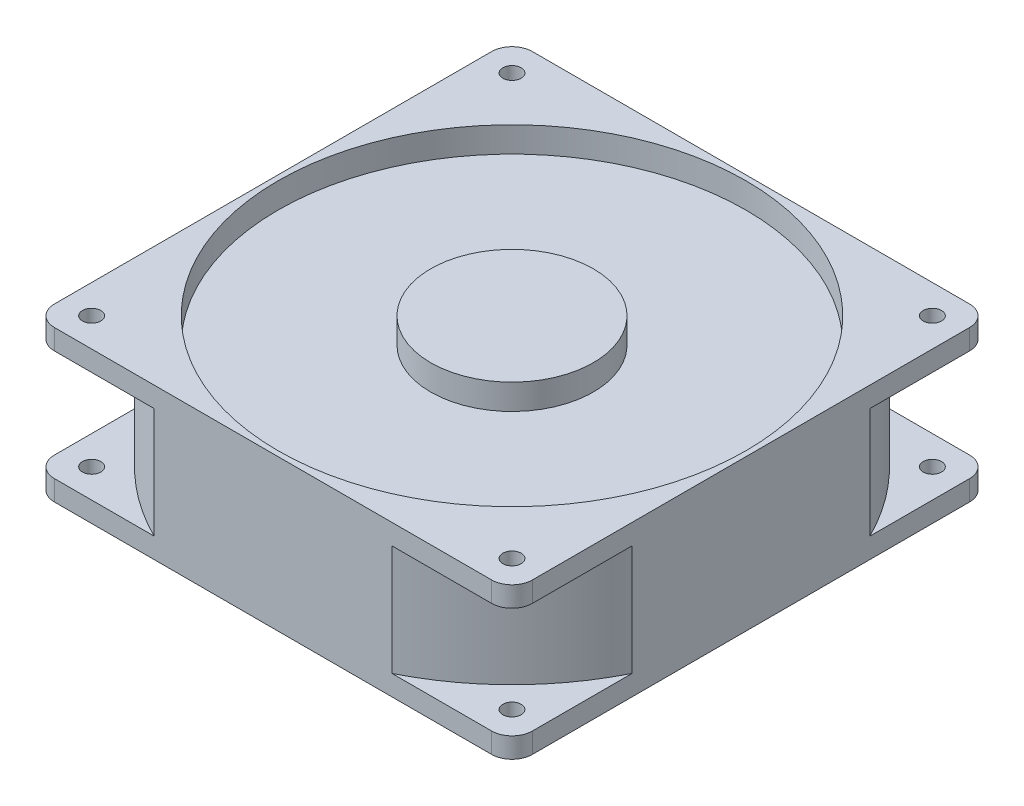
ISO-10303-21;
HEADER;
FILE_DESCRIPTION(('STEP AP214'),'2;1');
FILE_NAME('part.step','',(''),(''),'','','');
FILE_SCHEMA(('AUTOMOTIVE_DESIGN { 1 0 10303 214 1 1 1 1 }'));
ENDSEC;
DATA;
#1=APPLICATION_CONTEXT('core data for automotive mechanical design processes');
#2=APPLICATION_PROTOCOL_DEFINITION('international standard','automotive_design',2000,#1);
#3=PRODUCT_CONTEXT('',#1,'mechanical');
#4=PRODUCT('Part','Part','',(#3));
#5=PRODUCT_RELATED_PRODUCT_CATEGORY('part','',(#4));
#6=PRODUCT_DEFINITION_FORMATION('','',#4);
#7=PRODUCT_DEFINITION_CONTEXT('part definition',#1,'design');
#8=PRODUCT_DEFINITION('design','',#6,#7);
#9=PRODUCT_DEFINITION_SHAPE('','',#8);
#10=(LENGTH_UNIT() NAMED_UNIT(*) SI_UNIT(.MILLI.,.METRE.));
#11=(NAMED_UNIT(*) PLANE_ANGLE_UNIT() SI_UNIT($,.RADIAN.));
#12=(NAMED_UNIT(*) SI_UNIT($,.STERADIAN.) SOLID_ANGLE_UNIT());
#13=UNCERTAINTY_MEASURE_WITH_UNIT(LENGTH_MEASURE(1.E-05),#10,'distance_accuracy_value','');
#14=(GEOMETRIC_REPRESENTATION_CONTEXT(3) GLOBAL_UNCERTAINTY_ASSIGNED_CONTEXT((#13)) GLOBAL_UNIT_ASSIGNED_CONTEXT((#10,
#11,#12)) REPRESENTATION_CONTEXT('',''));
#15=CARTESIAN_POINT('',(0.,0.,0.));
#16=DIRECTION('',(0.,0.,1.));
#17=DIRECTION('',(1.,0.,0.));
#18=AXIS2_PLACEMENT_3D('',#15,#16,#17);
#19=CARTESIAN_POINT('',(2.67817733585345,37.75,-111.051162790698));
#20=DIRECTION('',(-1.,0.,0.));
#21=DIRECTION('',(0.,0.,1.));
#22=AXIS2_PLACEMENT_3D('',#19,#20,#21);
#23=PLANE('',#22);
#24=DIRECTION('',(0.,0.,-1.));
#25=VECTOR('',#24,1.);
#26=CARTESIAN_POINT('',(2.67817733585345,5.075,-111.051162790698));
#27=LINE('',#26,#25);
#28=CARTESIAN_POINT('',(2.67817733585345,5.075,3.24883720930234));
#29=VERTEX_POINT('',#28);
#30=CARTESIAN_POINT('',(2.67817733585345,5.075,-21.6515763748621));
#31=VERTEX_POINT('',#30);
#32=EDGE_CURVE('E368',#29,#31,#27,.T.);
#33=ORIENTED_EDGE('',*,*,#32,.F.);
#34=DIRECTION('',(0.,-1.,0.));
#35=VECTOR('',#34,1.);
#36=CARTESIAN_POINT('',(2.67817733585345,37.75,3.24883720930234));
#37=LINE('',#36,#35);
#38=CARTESIAN_POINT('',(2.67817733585345,0.,3.24883720930234));
#39=VERTEX_POINT('',#38);
#40=EDGE_CURVE('E268',#29,#39,#37,.T.);
#41=ORIENTED_EDGE('',*,*,#40,.T.);
#42=DIRECTION('',(0.,0.,-1.));
#43=VECTOR('',#42,1.);
#44=CARTESIAN_POINT('',(2.67817733585345,0.,-111.051162790698));
#45=LINE('',#44,#43);
#46=CARTESIAN_POINT('',(2.67817733585345,0.,-105.971162790698));
#47=VERTEX_POINT('',#46);
#48=EDGE_CURVE('E283',#39,#47,#45,.T.);
#49=ORIENTED_EDGE('',*,*,#48,.T.);
#50=DIRECTION('',(0.,-1.,0.));
#51=VECTOR('',#50,1.);
#52=CARTESIAN_POINT('',(2.67817733585345,37.75,-105.971162790698));
#53=LINE('',#52,#51);
#54=CARTESIAN_POINT('',(2.67817733585346,5.075,-105.971162790698));
#55=VERTEX_POINT('',#54);
#56=EDGE_CURVE('E269',#47,#55,#53,.F.);
#57=ORIENTED_EDGE('',*,*,#56,.T.);
#58=CARTESIAN_POINT('',(2.67817733585345,5.075,-81.0707492065333));
#59=VERTEX_POINT('',#58);
#60=EDGE_CURVE('E378',#59,#55,#27,.T.);
#61=ORIENTED_EDGE('',*,*,#60,.F.);
#62=DIRECTION('',(0.,1.,0.));
#63=VECTOR('',#62,1.);
#64=CARTESIAN_POINT('',(2.67817733585345,5.075,-81.0707492065333));
#65=LINE('',#64,#63);
#66=CARTESIAN_POINT('',(2.67817733585345,32.675,-81.0707492065333));
#67=VERTEX_POINT('',#66);
#68=EDGE_CURVE('E346',#67,#59,#65,.F.);
#69=ORIENTED_EDGE('',*,*,#68,.F.);
#70=DIRECTION('',(0.,0.,-1.));
#71=VECTOR('',#70,1.);
#72=CARTESIAN_POINT('',(2.67817733585345,32.675,-111.051162790698));
#73=LINE('',#72,#71);
#74=CARTESIAN_POINT('',(2.67817733585346,32.675,-105.971162790698));
#75=VERTEX_POINT('',#74);
#76=EDGE_CURVE('E404',#67,#75,#73,.T.);
#77=ORIENTED_EDGE('',*,*,#76,.T.);
#78=CARTESIAN_POINT('',(2.67817733585345,37.75,-105.971162790698));
#79=VERTEX_POINT('',#78);
#80=EDGE_CURVE('E272',#75,#79,#53,.F.);
#81=ORIENTED_EDGE('',*,*,#80,.T.);
#82=DIRECTION('',(0.,0.,-1.));
#83=VECTOR('',#82,1.);
#84=CARTESIAN_POINT('',(2.67817733585345,37.75,-111.051162790698));
#85=LINE('',#84,#83);
#86=CARTESIAN_POINT('',(2.67817733585345,37.75,3.24883720930234));
#87=VERTEX_POINT('',#86);
#88=EDGE_CURVE('E276',#87,#79,#85,.T.);
#89=ORIENTED_EDGE('',*,*,#88,.F.);
#90=CARTESIAN_POINT('',(2.67817733585345,32.675,3.24883720930234));
#91=VERTEX_POINT('',#90);
#92=EDGE_CURVE('E265',#87,#91,#37,.T.);
#93=ORIENTED_EDGE('',*,*,#92,.T.);
#94=CARTESIAN_POINT('',(2.67817733585345,32.675,-21.6515763748621));
#95=VERTEX_POINT('',#94);
#96=EDGE_CURVE('E50',#91,#95,#73,.T.);
#97=ORIENTED_EDGE('',*,*,#96,.T.);
#98=DIRECTION('',(0.,1.,0.));
#99=VECTOR('',#98,1.);
#100=CARTESIAN_POINT('',(2.67817733585345,5.075,-21.6515763748621));
#101=LINE('',#100,#99);
#102=EDGE_CURVE('E210',#31,#95,#101,.T.);
#103=ORIENTED_EDGE('',*,*,#102,.F.);
#104=EDGE_LOOP('',(#33,#41,#49,#57,#61,#69,#77,#81,#89,#93,#97,#103));
#105=FACE_BOUND('',#104,.T.);
#106=ADVANCED_FACE('F35',(#105),#23,.F.);
#107=CARTESIAN_POINT('',(-116.701822664147,37.75,-111.051162790698));
#108=DIRECTION('',(0.,0.,1.));
#109=DIRECTION('',(1.,0.,0.));
#110=AXIS2_PLACEMENT_3D('',#107,#108,#109);
#111=PLANE('',#110);
#112=DIRECTION('',(-1.,0.,0.));
#113=VECTOR('',#112,1.);
#114=CARTESIAN_POINT('',(-116.701822664147,5.075,-111.051162790698));
#115=LINE('',#114,#113);
#116=CARTESIAN_POINT('',(-2.40182266414654,5.075,-111.051162790698));
#117=VERTEX_POINT('',#116);
#118=CARTESIAN_POINT('',(-27.302236248311,5.075,-111.051162790698));
#119=VERTEX_POINT('',#118);
#120=EDGE_CURVE('E380',#117,#119,#115,.T.);
#121=ORIENTED_EDGE('',*,*,#120,.F.);
#122=DIRECTION('',(0.,-1.,0.));
#123=VECTOR('',#122,1.);
#124=CARTESIAN_POINT('',(-2.40182266414654,37.75,-111.051162790698));
#125=LINE('',#124,#123);
#126=CARTESIAN_POINT('',(-2.40182266414654,0.,-111.051162790698));
#127=VERTEX_POINT('',#126);
#128=EDGE_CURVE('E229',#117,#127,#125,.T.);
#129=ORIENTED_EDGE('',*,*,#128,.T.);
#130=DIRECTION('',(-1.,0.,0.));
#131=VECTOR('',#130,1.);
#132=CARTESIAN_POINT('',(-116.701822664147,0.,-111.051162790698));
#133=LINE('',#132,#131);
#134=CARTESIAN_POINT('',(-111.621822664147,0.,-111.051162790698));
#135=VERTEX_POINT('',#134);
#136=EDGE_CURVE('E280',#127,#135,#133,.T.);
#137=ORIENTED_EDGE('',*,*,#136,.T.);
#138=DIRECTION('',(0.,-1.,0.));
#139=VECTOR('',#138,1.);
#140=CARTESIAN_POINT('',(-111.621822664147,37.75,-111.051162790698));
#141=LINE('',#140,#139);
#142=CARTESIAN_POINT('',(-111.621822664147,5.075,-111.051162790698));
#143=VERTEX_POINT('',#142);
#144=EDGE_CURVE('E230',#135,#143,#141,.F.);
#145=ORIENTED_EDGE('',*,*,#144,.T.);
#146=CARTESIAN_POINT('',(-86.7214090799821,5.075,-111.051162790698));
#147=VERTEX_POINT('',#146);
#148=EDGE_CURVE('E384',#147,#143,#115,.T.);
#149=ORIENTED_EDGE('',*,*,#148,.F.);
#150=DIRECTION('',(0.,1.,0.));
#151=VECTOR('',#150,1.);
#152=CARTESIAN_POINT('',(-86.7214090799821,5.075,-111.051162790698));
#153=LINE('',#152,#151);
#154=CARTESIAN_POINT('',(-86.7214090799821,32.675,-111.051162790698));
#155=VERTEX_POINT('',#154);
#156=EDGE_CURVE('E350',#155,#147,#153,.F.);
#157=ORIENTED_EDGE('',*,*,#156,.F.);
#158=DIRECTION('',(-1.,0.,0.));
#159=VECTOR('',#158,1.);
#160=CARTESIAN_POINT('',(-116.701822664147,32.675,-111.051162790698));
#161=LINE('',#160,#159);
#162=CARTESIAN_POINT('',(-111.621822664147,32.675,-111.051162790698));
#163=VERTEX_POINT('',#162);
#164=EDGE_CURVE('E410',#155,#163,#161,.T.);
#165=ORIENTED_EDGE('',*,*,#164,.T.);
#166=CARTESIAN_POINT('',(-111.621822664147,37.75,-111.051162790698));
#167=VERTEX_POINT('',#166);
#168=EDGE_CURVE('E233',#163,#167,#141,.F.);
#169=ORIENTED_EDGE('',*,*,#168,.T.);
#170=DIRECTION('',(-1.,0.,0.));
#171=VECTOR('',#170,1.);
#172=CARTESIAN_POINT('',(-116.701822664147,37.75,-111.051162790698));
#173=LINE('',#172,#171);
#174=CARTESIAN_POINT('',(-2.40182266414654,37.75,-111.051162790698));
#175=VERTEX_POINT('',#174);
#176=EDGE_CURVE('E293',#175,#167,#173,.T.);
#177=ORIENTED_EDGE('',*,*,#176,.F.);
#178=CARTESIAN_POINT('',(-2.40182266414654,32.675,-111.051162790698));
#179=VERTEX_POINT('',#178);
#180=EDGE_CURVE('E226',#175,#179,#125,.T.);
#181=ORIENTED_EDGE('',*,*,#180,.T.);
#182=CARTESIAN_POINT('',(-27.302236248311,32.675,-111.051162790698));
#183=VERTEX_POINT('',#182);
#184=EDGE_CURVE('E407',#179,#183,#161,.T.);
#185=ORIENTED_EDGE('',*,*,#184,.T.);
#186=DIRECTION('',(0.,1.,0.));
#187=VECTOR('',#186,1.);
#188=CARTESIAN_POINT('',(-27.302236248311,5.075,-111.051162790698));
#189=LINE('',#188,#187);
#190=EDGE_CURVE('E348',#119,#183,#189,.T.);
#191=ORIENTED_EDGE('',*,*,#190,.F.);
#192=EDGE_LOOP('',(#121,#129,#137,#145,#149,#157,#165,#169,#177,#181,#185,#191));
#193=FACE_BOUND('',#192,.T.);
#194=ADVANCED_FACE('F451',(#193),#111,.F.);
#195=CARTESIAN_POINT('',(-116.701822664147,37.75,-111.051162790698));
#196=DIRECTION('',(1.,0.,0.));
#197=DIRECTION('',(0.,0.,-1.));
#198=AXIS2_PLACEMENT_3D('',#195,#196,#197);
#199=PLANE('',#198);
#200=DIRECTION('',(0.,0.,1.));
#201=VECTOR('',#200,1.);
#202=CARTESIAN_POINT('',(-116.701822664147,5.075,-111.051162790698));
#203=LINE('',#202,#201);
#204=CARTESIAN_POINT('',(-116.701822664147,5.075,-105.971162790698));
#205=VERTEX_POINT('',#204);
#206=CARTESIAN_POINT('',(-116.701822664147,5.075,-81.0707492065333));
#207=VERTEX_POINT('',#206);
#208=EDGE_CURVE('E386',#205,#207,#203,.T.);
#209=ORIENTED_EDGE('',*,*,#208,.F.);
#210=DIRECTION('',(0.,-1.,0.));
#211=VECTOR('',#210,1.);
#212=CARTESIAN_POINT('',(-116.701822664147,37.75,-105.971162790698));
#213=LINE('',#212,#211);
#214=CARTESIAN_POINT('',(-116.701822664147,0.,-105.971162790698));
#215=VERTEX_POINT('',#214);
#216=EDGE_CURVE('E241',#205,#215,#213,.T.);
#217=ORIENTED_EDGE('',*,*,#216,.T.);
#218=DIRECTION('',(0.,0.,1.));
#219=VECTOR('',#218,1.);
#220=CARTESIAN_POINT('',(-116.701822664147,0.,-111.051162790698));
#221=LINE('',#220,#219);
#222=CARTESIAN_POINT('',(-116.701822664147,0.,3.24883720930234));
#223=VERTEX_POINT('',#222);
#224=EDGE_CURVE('E277',#215,#223,#221,.T.);
#225=ORIENTED_EDGE('',*,*,#224,.T.);
#226=DIRECTION('',(0.,-1.,0.));
#227=VECTOR('',#226,1.);
#228=CARTESIAN_POINT('',(-116.701822664147,37.75,3.24883720930234));
#229=LINE('',#228,#227);
#230=CARTESIAN_POINT('',(-116.701822664147,5.075,3.24883720930234));
#231=VERTEX_POINT('',#230);
#232=EDGE_CURVE('E234',#223,#231,#229,.F.);
#233=ORIENTED_EDGE('',*,*,#232,.T.);
#234=CARTESIAN_POINT('',(-116.701822664147,5.075,-21.6515763748621));
#235=VERTEX_POINT('',#234);
#236=EDGE_CURVE('E372',#235,#231,#203,.T.);
#237=ORIENTED_EDGE('',*,*,#236,.F.);
#238=DIRECTION('',(0.,1.,0.));
#239=VECTOR('',#238,1.);
#240=CARTESIAN_POINT('',(-116.701822664147,5.075,-21.6515763748621));
#241=LINE('',#240,#239);
#242=CARTESIAN_POINT('',(-116.701822664147,32.675,-21.6515763748621));
#243=VERTEX_POINT('',#242);
#244=EDGE_CURVE('E354',#243,#235,#241,.F.);
#245=ORIENTED_EDGE('',*,*,#244,.F.);
#246=DIRECTION('',(0.,0.,1.));
#247=VECTOR('',#246,1.);
#248=CARTESIAN_POINT('',(-116.701822664147,32.675,-111.051162790698));
#249=LINE('',#248,#247);
#250=CARTESIAN_POINT('',(-116.701822664147,32.675,3.24883720930234));
#251=VERTEX_POINT('',#250);
#252=EDGE_CURVE('E400',#243,#251,#249,.T.);
#253=ORIENTED_EDGE('',*,*,#252,.T.);
#254=CARTESIAN_POINT('',(-116.701822664147,37.75,3.24883720930234));
#255=VERTEX_POINT('',#254);
#256=EDGE_CURVE('E237',#251,#255,#229,.F.);
#257=ORIENTED_EDGE('',*,*,#256,.T.);
#258=DIRECTION('',(0.,0.,1.));
#259=VECTOR('',#258,1.);
#260=CARTESIAN_POINT('',(-116.701822664147,37.75,-111.051162790698));
#261=LINE('',#260,#259);
#262=CARTESIAN_POINT('',(-116.701822664147,37.75,-105.971162790698));
#263=VERTEX_POINT('',#262);
#264=EDGE_CURVE('E290',#263,#255,#261,.T.);
#265=ORIENTED_EDGE('',*,*,#264,.F.);
#266=CARTESIAN_POINT('',(-116.701822664147,32.675,-105.971162790698));
#267=VERTEX_POINT('',#266);
#268=EDGE_CURVE('E238',#263,#267,#213,.T.);
#269=ORIENTED_EDGE('',*,*,#268,.T.);
#270=CARTESIAN_POINT('',(-116.701822664147,32.675,-81.0707492065333));
#271=VERTEX_POINT('',#270);
#272=EDGE_CURVE('E413',#267,#271,#249,.T.);
#273=ORIENTED_EDGE('',*,*,#272,.T.);
#274=DIRECTION('',(0.,1.,0.));
#275=VECTOR('',#274,1.);
#276=CARTESIAN_POINT('',(-116.701822664147,5.075,-81.0707492065333));
#277=LINE('',#276,#275);
#278=EDGE_CURVE('E352',#207,#271,#277,.T.);
#279=ORIENTED_EDGE('',*,*,#278,.F.);
#280=EDGE_LOOP('',(#209,#217,#225,#233,#237,#245,#253,#257,#265,#269,#273,#279));
#281=FACE_BOUND('',#280,.T.);
#282=ADVANCED_FACE('F436',(#281),#199,.F.);
#283=CARTESIAN_POINT('',(-116.701822664147,37.75,8.32883720930234));
#284=DIRECTION('',(0.,0.,-1.));
#285=DIRECTION('',(-1.,0.,0.));
#286=AXIS2_PLACEMENT_3D('',#283,#284,#285);
#287=PLANE('',#286);
#288=DIRECTION('',(1.,0.,0.));
#289=VECTOR('',#288,1.);
#290=CARTESIAN_POINT('',(-116.701822664147,5.075,8.32883720930234));
#291=LINE('',#290,#289);
#292=CARTESIAN_POINT('',(-111.621822664147,5.075,8.32883720930234));
#293=VERTEX_POINT('',#292);
#294=CARTESIAN_POINT('',(-86.7214090799821,5.075,8.32883720930234));
#295=VERTEX_POINT('',#294);
#296=EDGE_CURVE('E373',#293,#295,#291,.T.);
#297=ORIENTED_EDGE('',*,*,#296,.F.);
#298=DIRECTION('',(0.,-1.,0.));
#299=VECTOR('',#298,1.);
#300=CARTESIAN_POINT('',(-111.621822664147,37.75,8.32883720930234));
#301=LINE('',#300,#299);
#302=CARTESIAN_POINT('',(-111.621822664147,0.,8.32883720930234));
#303=VERTEX_POINT('',#302);
#304=EDGE_CURVE('E256',#293,#303,#301,.T.);
#305=ORIENTED_EDGE('',*,*,#304,.T.);
#306=DIRECTION('',(1.,0.,0.));
#307=VECTOR('',#306,1.);
#308=CARTESIAN_POINT('',(-116.701822664147,0.,8.32883720930234));
#309=LINE('',#308,#307);
#310=CARTESIAN_POINT('',(-2.40182266414657,0.,8.32883720930234));
#311=VERTEX_POINT('',#310);
#312=EDGE_CURVE('E273',#303,#311,#309,.T.);
#313=ORIENTED_EDGE('',*,*,#312,.T.);
#314=DIRECTION('',(0.,-1.,0.));
#315=VECTOR('',#314,1.);
#316=CARTESIAN_POINT('',(-2.40182266414654,37.75,8.32883720930234));
#317=LINE('',#316,#315);
#318=CARTESIAN_POINT('',(-2.40182266414655,5.075,8.32883720930234));
#319=VERTEX_POINT('',#318);
#320=EDGE_CURVE('E250',#311,#319,#317,.F.);
#321=ORIENTED_EDGE('',*,*,#320,.T.);
#322=CARTESIAN_POINT('',(-27.302236248311,5.075,8.32883720930234));
#323=VERTEX_POINT('',#322);
#324=EDGE_CURVE('E219',#323,#319,#291,.T.);
#325=ORIENTED_EDGE('',*,*,#324,.F.);
#326=DIRECTION('',(0.,1.,0.));
#327=VECTOR('',#326,1.);
#328=CARTESIAN_POINT('',(-27.302236248311,5.075,8.32883720930234));
#329=LINE('',#328,#327);
#330=CARTESIAN_POINT('',(-27.302236248311,32.675,8.32883720930234));
#331=VERTEX_POINT('',#330);
#332=EDGE_CURVE('E43',#331,#323,#329,.F.);
#333=ORIENTED_EDGE('',*,*,#332,.F.);
#334=DIRECTION('',(1.,0.,0.));
#335=VECTOR('',#334,1.);
#336=CARTESIAN_POINT('',(-116.701822664147,32.675,8.32883720930234));
#337=LINE('',#336,#335);
#338=CARTESIAN_POINT('',(-2.40182266414655,32.675,8.32883720930234));
#339=VERTEX_POINT('',#338);
#340=EDGE_CURVE('E195',#331,#339,#337,.T.);
#341=ORIENTED_EDGE('',*,*,#340,.T.);
#342=CARTESIAN_POINT('',(-2.40182266414657,37.75,8.32883720930234));
#343=VERTEX_POINT('',#342);
#344=EDGE_CURVE('E252',#339,#343,#317,.F.);
#345=ORIENTED_EDGE('',*,*,#344,.T.);
#346=DIRECTION('',(1.,0.,0.));
#347=VECTOR('',#346,1.);
#348=CARTESIAN_POINT('',(-116.701822664147,37.75,8.32883720930234));
#349=LINE('',#348,#347);
#350=CARTESIAN_POINT('',(-111.621822664147,37.75,8.32883720930234));
#351=VERTEX_POINT('',#350);
#352=EDGE_CURVE('E287',#351,#343,#349,.T.);
#353=ORIENTED_EDGE('',*,*,#352,.F.);
#354=CARTESIAN_POINT('',(-111.621822664147,32.675,8.32883720930234));
#355=VERTEX_POINT('',#354);
#356=EDGE_CURVE('E253',#351,#355,#301,.T.);
#357=ORIENTED_EDGE('',*,*,#356,.T.);
#358=CARTESIAN_POINT('',(-86.7214090799821,32.675,8.32883720930234));
#359=VERTEX_POINT('',#358);
#360=EDGE_CURVE('E58',#355,#359,#337,.T.);
#361=ORIENTED_EDGE('',*,*,#360,.T.);
#362=DIRECTION('',(0.,1.,0.));
#363=VECTOR('',#362,1.);
#364=CARTESIAN_POINT('',(-86.7214090799821,5.075,8.32883720930234));
#365=LINE('',#364,#363);
#366=EDGE_CURVE('E11',#295,#359,#365,.T.);
#367=ORIENTED_EDGE('',*,*,#366,.F.);
#368=EDGE_LOOP('',(#297,#305,#313,#321,#325,#333,#341,#345,#353,#357,#361,#367));
#369=FACE_BOUND('',#368,.T.);
#370=ADVANCED_FACE('F217',(#369),#287,.F.);
#371=CARTESIAN_POINT('',(-109.511822664147,0.,-103.861162790698));
#372=DIRECTION('',(0.,1.,0.));
#373=DIRECTION('',(0.,0.,1.));
#374=AXIS2_PLACEMENT_3D('',#371,#372,#373);
#375=CYLINDRICAL_SURFACE('',#374,2.28599999999999);
#376=CARTESIAN_POINT('',(-109.511822664147,0.,-103.861162790698));
#377=DIRECTION('',(0.,1.,0.));
#378=DIRECTION('',(0.,0.,1.));
#379=AXIS2_PLACEMENT_3D('',#376,#377,#378);
#380=CIRCLE('',#379,2.28599999999999);
#381=CARTESIAN_POINT('',(-109.511822664147,0.,-101.575162790698));
#382=VERTEX_POINT('',#381);
#383=EDGE_CURVE('E286',#382,#382,#380,.T.);
#384=ORIENTED_EDGE('',*,*,#383,.F.);
#385=EDGE_LOOP('',(#384));
#386=FACE_BOUND('',#385,.T.);
#387=CARTESIAN_POINT('',(-109.511822664147,5.075,-103.861162790698));
#388=DIRECTION('',(0.,1.,0.));
#389=DIRECTION('',(0.,0.,1.));
#390=AXIS2_PLACEMENT_3D('',#387,#388,#389);
#391=CIRCLE('',#390,2.28599999999999);
#392=CARTESIAN_POINT('',(-109.511822664147,5.075,-101.575162790698));
#393=VERTEX_POINT('',#392);
#394=EDGE_CURVE('E356',#393,#393,#391,.F.);
#395=ORIENTED_EDGE('',*,*,#394,.F.);
#396=EDGE_LOOP('',(#395));
#397=FACE_BOUND('',#396,.T.);
#398=ADVANCED_FACE('F534',(#386,#397),#375,.F.);
#399=CARTESIAN_POINT('',(-109.511822664147,0.,1.1388372093023));
#400=DIRECTION('',(0.,1.,0.));
#401=DIRECTION('',(0.,0.,1.));
#402=AXIS2_PLACEMENT_3D('',#399,#400,#401);
#403=CYLINDRICAL_SURFACE('',#402,2.28599999999999);
#404=CARTESIAN_POINT('',(-109.511822664147,0.,1.1388372093023));
#405=DIRECTION('',(0.,1.,0.));
#406=DIRECTION('',(0.,0.,1.));
#407=AXIS2_PLACEMENT_3D('',#404,#405,#406);
#408=CIRCLE('',#407,2.28599999999999);
#409=CARTESIAN_POINT('',(-109.511822664147,0.,3.4248372093023));
#410=VERTEX_POINT('',#409);
#411=EDGE_CURVE('E307',#410,#410,#408,.T.);
#412=ORIENTED_EDGE('',*,*,#411,.F.);
#413=EDGE_LOOP('',(#412));
#414=FACE_BOUND('',#413,.T.);
#415=CARTESIAN_POINT('',(-109.511822664147,5.075,1.1388372093023));
#416=DIRECTION('',(0.,1.,0.));
#417=DIRECTION('',(0.,0.,1.));
#418=AXIS2_PLACEMENT_3D('',#415,#416,#417);
#419=CIRCLE('',#418,2.28599999999999);
#420=CARTESIAN_POINT('',(-109.511822664147,5.075,3.4248372093023));
#421=VERTEX_POINT('',#420);
#422=EDGE_CURVE('E359',#421,#421,#419,.F.);
#423=ORIENTED_EDGE('',*,*,#422,.F.);
#424=EDGE_LOOP('',(#423));
#425=FACE_BOUND('',#424,.T.);
#426=ADVANCED_FACE('F551',(#414,#425),#403,.F.);
#427=CARTESIAN_POINT('',(-4.51182266414656,0.,1.1388372093023));
#428=DIRECTION('',(0.,1.,0.));
#429=DIRECTION('',(0.,0.,1.));
#430=AXIS2_PLACEMENT_3D('',#427,#428,#429);
#431=CYLINDRICAL_SURFACE('',#430,2.28600000000001);
#432=CARTESIAN_POINT('',(-4.51182266414656,0.,1.1388372093023));
#433=DIRECTION('',(0.,1.,0.));
#434=DIRECTION('',(0.,0.,1.));
#435=AXIS2_PLACEMENT_3D('',#432,#433,#434);
#436=CIRCLE('',#435,2.28600000000001);
#437=CARTESIAN_POINT('',(-4.51182266414656,0.,3.42483720930231));
#438=VERTEX_POINT('',#437);
#439=EDGE_CURVE('E314',#438,#438,#436,.T.);
#440=ORIENTED_EDGE('',*,*,#439,.F.);
#441=EDGE_LOOP('',(#440));
#442=FACE_BOUND('',#441,.T.);
#443=CARTESIAN_POINT('',(-4.51182266414656,5.075,1.1388372093023));
#444=DIRECTION('',(0.,1.,0.));
#445=DIRECTION('',(0.,0.,1.));
#446=AXIS2_PLACEMENT_3D('',#443,#444,#445);
#447=CIRCLE('',#446,2.28600000000001);
#448=CARTESIAN_POINT('',(-4.51182266414656,5.075,3.42483720930231));
#449=VERTEX_POINT('',#448);
#450=EDGE_CURVE('E362',#449,#449,#447,.F.);
#451=ORIENTED_EDGE('',*,*,#450,.F.);
#452=EDGE_LOOP('',(#451));
#453=FACE_BOUND('',#452,.T.);
#454=ADVANCED_FACE('F556',(#442,#453),#431,.F.);
#455=CARTESIAN_POINT('',(-4.51182266414654,0.,-103.861162790698));
#456=DIRECTION('',(0.,1.,0.));
#457=DIRECTION('',(0.,0.,1.));
#458=AXIS2_PLACEMENT_3D('',#455,#456,#457);
#459=CYLINDRICAL_SURFACE('',#458,2.28600000000001);
#460=CARTESIAN_POINT('',(-4.51182266414654,0.,-103.861162790698));
#461=DIRECTION('',(0.,1.,0.));
#462=DIRECTION('',(0.,0.,1.));
#463=AXIS2_PLACEMENT_3D('',#460,#461,#462);
#464=CIRCLE('',#463,2.28600000000001);
#465=CARTESIAN_POINT('',(-4.51182266414654,0.,-101.575162790698));
#466=VERTEX_POINT('',#465);
#467=EDGE_CURVE('E301',#466,#466,#464,.T.);
#468=ORIENTED_EDGE('',*,*,#467,.F.);
#469=EDGE_LOOP('',(#468));
#470=FACE_BOUND('',#469,.T.);
#471=CARTESIAN_POINT('',(-4.51182266414654,5.075,-103.861162790698));
#472=DIRECTION('',(0.,1.,0.));
#473=DIRECTION('',(0.,0.,1.));
#474=AXIS2_PLACEMENT_3D('',#471,#472,#473);
#475=CIRCLE('',#474,2.28600000000001);
#476=CARTESIAN_POINT('',(-4.51182266414654,5.075,-101.575162790698));
#477=VERTEX_POINT('',#476);
#478=EDGE_CURVE('E365',#477,#477,#475,.F.);
#479=ORIENTED_EDGE('',*,*,#478,.F.);
#480=EDGE_LOOP('',(#479));
#481=FACE_BOUND('',#480,.T.);
#482=ADVANCED_FACE('F523',(#470,#481),#459,.F.);
#483=CARTESIAN_POINT('',(-2.40182266414655,37.75,3.24883720930234));
#484=DIRECTION('',(0.,-1.,0.));
#485=DIRECTION('',(0.,0.,-1.));
#486=AXIS2_PLACEMENT_3D('',#483,#484,#485);
#487=CYLINDRICAL_SURFACE('',#486,5.08);
#488=ORIENTED_EDGE('',*,*,#40,.F.);
#489=CARTESIAN_POINT('',(-2.40182266414655,5.075,3.24883720930234));
#490=DIRECTION('',(0.,1.,0.));
#491=DIRECTION('',(0.,0.,1.));
#492=AXIS2_PLACEMENT_3D('',#489,#490,#491);
#493=CIRCLE('',#492,5.08);
#494=EDGE_CURVE('E369',#29,#319,#493,.F.);
#495=ORIENTED_EDGE('',*,*,#494,.T.);
#496=ORIENTED_EDGE('',*,*,#320,.F.);
#497=CARTESIAN_POINT('',(-2.40182266414655,0.,3.24883720930234));
#498=DIRECTION('',(0.,1.,0.));
#499=DIRECTION('',(0.,0.,1.));
#500=AXIS2_PLACEMENT_3D('',#497,#498,#499);
#501=CIRCLE('',#500,5.08);
#502=EDGE_CURVE('E257',#39,#311,#501,.F.);
#503=ORIENTED_EDGE('',*,*,#502,.F.);
#504=EDGE_LOOP('',(#488,#495,#496,#503));
#505=FACE_BOUND('',#504,.T.);
#506=ADVANCED_FACE('F500',(#505),#487,.T.);
#507=CARTESIAN_POINT('',(-111.621822664147,37.75,3.24883720930234));
#508=DIRECTION('',(0.,-1.,0.));
#509=DIRECTION('',(0.,0.,-1.));
#510=AXIS2_PLACEMENT_3D('',#507,#508,#509);
#511=CYLINDRICAL_SURFACE('',#510,5.08);
#512=ORIENTED_EDGE('',*,*,#304,.F.);
#513=CARTESIAN_POINT('',(-111.621822664147,5.075,3.24883720930234));
#514=DIRECTION('',(0.,1.,0.));
#515=DIRECTION('',(0.,0.,1.));
#516=AXIS2_PLACEMENT_3D('',#513,#514,#515);
#517=CIRCLE('',#516,5.08);
#518=EDGE_CURVE('E375',#293,#231,#517,.F.);
#519=ORIENTED_EDGE('',*,*,#518,.T.);
#520=ORIENTED_EDGE('',*,*,#232,.F.);
#521=CARTESIAN_POINT('',(-111.621822664147,0.,3.24883720930234));
#522=DIRECTION('',(0.,1.,0.));
#523=DIRECTION('',(0.,0.,1.));
#524=AXIS2_PLACEMENT_3D('',#521,#522,#523);
#525=CIRCLE('',#524,5.08);
#526=EDGE_CURVE('E259',#303,#223,#525,.F.);
#527=ORIENTED_EDGE('',*,*,#526,.F.);
#528=EDGE_LOOP('',(#512,#519,#520,#527));
#529=FACE_BOUND('',#528,.T.);
#530=ADVANCED_FACE('F489',(#529),#511,.T.);
#531=CARTESIAN_POINT('',(-2.40182266414654,37.75,-105.971162790698));
#532=DIRECTION('',(0.,-1.,0.));
#533=DIRECTION('',(0.,0.,-1.));
#534=AXIS2_PLACEMENT_3D('',#531,#532,#533);
#535=CYLINDRICAL_SURFACE('',#534,5.08);
#536=ORIENTED_EDGE('',*,*,#128,.F.);
#537=CARTESIAN_POINT('',(-2.40182266414654,5.075,-105.971162790698));
#538=DIRECTION('',(0.,1.,0.));
#539=DIRECTION('',(0.,0.,1.));
#540=AXIS2_PLACEMENT_3D('',#537,#538,#539);
#541=CIRCLE('',#540,5.08);
#542=EDGE_CURVE('E381',#117,#55,#541,.F.);
#543=ORIENTED_EDGE('',*,*,#542,.T.);
#544=ORIENTED_EDGE('',*,*,#56,.F.);
#545=CARTESIAN_POINT('',(-2.40182266414654,0.,-105.971162790698));
#546=DIRECTION('',(0.,1.,0.));
#547=DIRECTION('',(0.,0.,1.));
#548=AXIS2_PLACEMENT_3D('',#545,#546,#547);
#549=CIRCLE('',#548,5.08);
#550=EDGE_CURVE('E261',#127,#47,#549,.F.);
#551=ORIENTED_EDGE('',*,*,#550,.F.);
#552=EDGE_LOOP('',(#536,#543,#544,#551));
#553=FACE_BOUND('',#552,.T.);
#554=ADVANCED_FACE('F666',(#553),#535,.T.);
#555=CARTESIAN_POINT('',(-111.621822664147,37.75,-105.971162790698));
#556=DIRECTION('',(0.,-1.,0.));
#557=DIRECTION('',(0.,0.,-1.));
#558=AXIS2_PLACEMENT_3D('',#555,#556,#557);
#559=CYLINDRICAL_SURFACE('',#558,5.08);
#560=ORIENTED_EDGE('',*,*,#216,.F.);
#561=CARTESIAN_POINT('',(-111.621822664147,5.075,-105.971162790698));
#562=DIRECTION('',(0.,1.,0.));
#563=DIRECTION('',(0.,0.,1.));
#564=AXIS2_PLACEMENT_3D('',#561,#562,#563);
#565=CIRCLE('',#564,5.08);
#566=EDGE_CURVE('E220',#205,#143,#565,.F.);
#567=ORIENTED_EDGE('',*,*,#566,.T.);
#568=ORIENTED_EDGE('',*,*,#144,.F.);
#569=CARTESIAN_POINT('',(-111.621822664147,0.,-105.971162790698));
#570=DIRECTION('',(0.,1.,0.));
#571=DIRECTION('',(0.,0.,1.));
#572=AXIS2_PLACEMENT_3D('',#569,#570,#571);
#573=CIRCLE('',#572,5.08);
#574=EDGE_CURVE('E263',#215,#135,#573,.F.);
#575=ORIENTED_EDGE('',*,*,#574,.F.);
#576=EDGE_LOOP('',(#560,#567,#568,#575));
#577=FACE_BOUND('',#576,.T.);
#578=ADVANCED_FACE('F541',(#577),#559,.T.);
#579=CARTESIAN_POINT('',(0.,37.75,0.));
#580=DIRECTION('',(0.,1.,0.));
#581=DIRECTION('',(0.,0.,1.));
#582=AXIS2_PLACEMENT_3D('',#579,#580,#581);
#583=PLANE('',#582);
#584=CARTESIAN_POINT('',(-57.0118226641465,37.75,-51.3611627906977));
#585=DIRECTION('',(0.,1.,0.));
#586=DIRECTION('',(0.,0.,1.));
#587=AXIS2_PLACEMENT_3D('',#584,#585,#586);
#588=CIRCLE('',#587,58.4197345497268);
#589=CARTESIAN_POINT('',(-57.0118226641465,37.75,7.05857175902914));
#590=VERTEX_POINT('',#589);
#591=EDGE_CURVE('E322',#590,#590,#588,.T.);
#592=ORIENTED_EDGE('',*,*,#591,.F.);
#593=EDGE_LOOP('',(#592));
#594=FACE_BOUND('',#593,.T.);
#595=CARTESIAN_POINT('',(-4.51182266414654,37.75,-103.861162790698));
#596=DIRECTION('',(0.,1.,0.));
#597=DIRECTION('',(0.,0.,1.));
#598=AXIS2_PLACEMENT_3D('',#595,#596,#597);
#599=CIRCLE('',#598,2.28600000000001);
#600=CARTESIAN_POINT('',(-4.51182266414654,37.75,-101.575162790698));
#601=VERTEX_POINT('',#600);
#602=EDGE_CURVE('E317',#601,#601,#599,.T.);
#603=ORIENTED_EDGE('',*,*,#602,.F.);
#604=EDGE_LOOP('',(#603));
#605=FACE_BOUND('',#604,.T.);
#606=CARTESIAN_POINT('',(-4.51182266414656,37.75,1.1388372093023));
#607=DIRECTION('',(0.,1.,0.));
#608=DIRECTION('',(0.,0.,1.));
#609=AXIS2_PLACEMENT_3D('',#606,#607,#608);
#610=CIRCLE('',#609,2.28600000000001);
#611=CARTESIAN_POINT('',(-4.51182266414656,37.75,3.42483720930231));
#612=VERTEX_POINT('',#611);
#613=EDGE_CURVE('E311',#612,#612,#610,.T.);
#614=ORIENTED_EDGE('',*,*,#613,.F.);
#615=EDGE_LOOP('',(#614));
#616=FACE_BOUND('',#615,.T.);
#617=CARTESIAN_POINT('',(-109.511822664147,37.75,1.1388372093023));
#618=DIRECTION('',(0.,1.,0.));
#619=DIRECTION('',(0.,0.,1.));
#620=AXIS2_PLACEMENT_3D('',#617,#618,#619);
#621=CIRCLE('',#620,2.28599999999999);
#622=CARTESIAN_POINT('',(-109.511822664147,37.75,3.4248372093023));
#623=VERTEX_POINT('',#622);
#624=EDGE_CURVE('E304',#623,#623,#621,.T.);
#625=ORIENTED_EDGE('',*,*,#624,.F.);
#626=EDGE_LOOP('',(#625));
#627=FACE_BOUND('',#626,.T.);
#628=CARTESIAN_POINT('',(-109.511822664147,37.75,-103.861162790698));
#629=DIRECTION('',(0.,1.,0.));
#630=DIRECTION('',(0.,0.,1.));
#631=AXIS2_PLACEMENT_3D('',#628,#629,#630);
#632=CIRCLE('',#631,2.28599999999999);
#633=CARTESIAN_POINT('',(-109.511822664147,37.75,-101.575162790698));
#634=VERTEX_POINT('',#633);
#635=EDGE_CURVE('E298',#634,#634,#632,.T.);
#636=ORIENTED_EDGE('',*,*,#635,.F.);
#637=EDGE_LOOP('',(#636));
#638=FACE_BOUND('',#637,.T.);
#639=ORIENTED_EDGE('',*,*,#352,.T.);
#640=CARTESIAN_POINT('',(-2.40182266414655,37.75,3.24883720930234));
#641=DIRECTION('',(0.,1.,0.));
#642=DIRECTION('',(0.,0.,1.));
#643=AXIS2_PLACEMENT_3D('',#640,#641,#642);
#644=CIRCLE('',#643,5.08);
#645=EDGE_CURVE('E242',#343,#87,#644,.T.);
#646=ORIENTED_EDGE('',*,*,#645,.T.);
#647=ORIENTED_EDGE('',*,*,#88,.T.);
#648=CARTESIAN_POINT('',(-2.40182266414654,37.75,-105.971162790698));
#649=DIRECTION('',(0.,1.,0.));
#650=DIRECTION('',(0.,0.,1.));
#651=AXIS2_PLACEMENT_3D('',#648,#649,#650);
#652=CIRCLE('',#651,5.08);
#653=EDGE_CURVE('E246',#79,#175,#652,.T.);
#654=ORIENTED_EDGE('',*,*,#653,.T.);
#655=ORIENTED_EDGE('',*,*,#176,.T.);
#656=CARTESIAN_POINT('',(-111.621822664147,37.75,-105.971162790698));
#657=DIRECTION('',(0.,1.,0.));
#658=DIRECTION('',(0.,0.,1.));
#659=AXIS2_PLACEMENT_3D('',#656,#657,#658);
#660=CIRCLE('',#659,5.08);
#661=EDGE_CURVE('E248',#167,#263,#660,.T.);
#662=ORIENTED_EDGE('',*,*,#661,.T.);
#663=ORIENTED_EDGE('',*,*,#264,.T.);
#664=CARTESIAN_POINT('',(-111.621822664147,37.75,3.24883720930234));
#665=DIRECTION('',(0.,1.,0.));
#666=DIRECTION('',(0.,0.,1.));
#667=AXIS2_PLACEMENT_3D('',#664,#665,#666);
#668=CIRCLE('',#667,5.08);
#669=EDGE_CURVE('E244',#255,#351,#668,.T.);
#670=ORIENTED_EDGE('',*,*,#669,.T.);
#671=EDGE_LOOP('',(#639,#646,#647,#654,#655,#662,#663,#670));
#672=FACE_BOUND('',#671,.T.);
#673=ADVANCED_FACE('F454',(#594,#605,#616,#627,#638,#672),#583,.T.);
#674=CARTESIAN_POINT('',(0.,0.,0.));
#675=DIRECTION('',(0.,1.,0.));
#676=DIRECTION('',(0.,0.,1.));
#677=AXIS2_PLACEMENT_3D('',#674,#675,#676);
#678=PLANE('',#677);
#679=CARTESIAN_POINT('',(-57.0118226641465,0.,-51.3611627906977));
#680=DIRECTION('',(0.,-1.,0.));
#681=DIRECTION('',(0.,0.,-1.));
#682=AXIS2_PLACEMENT_3D('',#679,#680,#681);
#683=CIRCLE('',#682,58.42);
#684=CARTESIAN_POINT('',(-57.0118226641465,0.,-109.781162790698));
#685=VERTEX_POINT('',#684);
#686=EDGE_CURVE('E328',#685,#685,#683,.T.);
#687=ORIENTED_EDGE('',*,*,#686,.F.);
#688=EDGE_LOOP('',(#687));
#689=FACE_BOUND('',#688,.T.);
#690=ORIENTED_EDGE('',*,*,#467,.T.);
#691=EDGE_LOOP('',(#690));
#692=FACE_BOUND('',#691,.T.);
#693=ORIENTED_EDGE('',*,*,#439,.T.);
#694=EDGE_LOOP('',(#693));
#695=FACE_BOUND('',#694,.T.);
#696=ORIENTED_EDGE('',*,*,#411,.T.);
#697=EDGE_LOOP('',(#696));
#698=FACE_BOUND('',#697,.T.);
#699=ORIENTED_EDGE('',*,*,#383,.T.);
#700=EDGE_LOOP('',(#699));
#701=FACE_BOUND('',#700,.T.);
#702=ORIENTED_EDGE('',*,*,#48,.F.);
#703=ORIENTED_EDGE('',*,*,#502,.T.);
#704=ORIENTED_EDGE('',*,*,#312,.F.);
#705=ORIENTED_EDGE('',*,*,#526,.T.);
#706=ORIENTED_EDGE('',*,*,#224,.F.);
#707=ORIENTED_EDGE('',*,*,#574,.T.);
#708=ORIENTED_EDGE('',*,*,#136,.F.);
#709=ORIENTED_EDGE('',*,*,#550,.T.);
#710=EDGE_LOOP('',(#702,#703,#704,#705,#706,#707,#708,#709));
#711=FACE_BOUND('',#710,.T.);
#712=ADVANCED_FACE('F495',(#689,#692,#695,#698,#701,#711),#678,.F.);
#713=CARTESIAN_POINT('',(-109.511822664147,32.675,-103.861162790698));
#714=DIRECTION('',(0.,1.,0.));
#715=DIRECTION('',(0.,0.,1.));
#716=AXIS2_PLACEMENT_3D('',#713,#714,#715);
#717=CIRCLE('',#716,2.28599999999999);
#718=CARTESIAN_POINT('',(-109.511822664147,32.675,-101.575162790698));
#719=VERTEX_POINT('',#718);
#720=EDGE_CURVE('E388',#719,#719,#717,.F.);
#721=ORIENTED_EDGE('',*,*,#720,.T.);
#722=EDGE_LOOP('',(#721));
#723=FACE_BOUND('',#722,.T.);
#724=ORIENTED_EDGE('',*,*,#635,.T.);
#725=EDGE_LOOP('',(#724));
#726=FACE_BOUND('',#725,.T.);
#727=ADVANCED_FACE('F537',(#723,#726),#375,.F.);
#728=CARTESIAN_POINT('',(-109.511822664147,32.675,1.1388372093023));
#729=DIRECTION('',(0.,1.,0.));
#730=DIRECTION('',(0.,0.,1.));
#731=AXIS2_PLACEMENT_3D('',#728,#729,#730);
#732=CIRCLE('',#731,2.28599999999999);
#733=CARTESIAN_POINT('',(-109.511822664147,32.675,3.4248372093023));
#734=VERTEX_POINT('',#733);
#735=EDGE_CURVE('E391',#734,#734,#732,.F.);
#736=ORIENTED_EDGE('',*,*,#735,.T.);
#737=EDGE_LOOP('',(#736));
#738=FACE_BOUND('',#737,.T.);
#739=ORIENTED_EDGE('',*,*,#624,.T.);
#740=EDGE_LOOP('',(#739));
#741=FACE_BOUND('',#740,.T.);
#742=ADVANCED_FACE('F545',(#738,#741),#403,.F.);
#743=CARTESIAN_POINT('',(-4.51182266414656,32.675,1.1388372093023));
#744=DIRECTION('',(0.,1.,0.));
#745=DIRECTION('',(0.,0.,1.));
#746=AXIS2_PLACEMENT_3D('',#743,#744,#745);
#747=CIRCLE('',#746,2.28600000000001);
#748=CARTESIAN_POINT('',(-4.51182266414656,32.675,3.42483720930231));
#749=VERTEX_POINT('',#748);
#750=EDGE_CURVE('E394',#749,#749,#747,.F.);
#751=ORIENTED_EDGE('',*,*,#750,.T.);
#752=EDGE_LOOP('',(#751));
#753=FACE_BOUND('',#752,.T.);
#754=ORIENTED_EDGE('',*,*,#613,.T.);
#755=EDGE_LOOP('',(#754));
#756=FACE_BOUND('',#755,.T.);
#757=ADVANCED_FACE('F549',(#753,#756),#431,.F.);
#758=CARTESIAN_POINT('',(-4.51182266414654,32.675,-103.861162790698));
#759=DIRECTION('',(0.,1.,0.));
#760=DIRECTION('',(0.,0.,1.));
#761=AXIS2_PLACEMENT_3D('',#758,#759,#760);
#762=CIRCLE('',#761,2.28600000000001);
#763=CARTESIAN_POINT('',(-4.51182266414654,32.675,-101.575162790698));
#764=VERTEX_POINT('',#763);
#765=EDGE_CURVE('E397',#764,#764,#762,.F.);
#766=ORIENTED_EDGE('',*,*,#765,.T.);
#767=EDGE_LOOP('',(#766));
#768=FACE_BOUND('',#767,.T.);
#769=ORIENTED_EDGE('',*,*,#602,.T.);
#770=EDGE_LOOP('',(#769));
#771=FACE_BOUND('',#770,.T.);
#772=ADVANCED_FACE('F554',(#768,#771),#459,.F.);
#773=CARTESIAN_POINT('',(-57.0118226641465,31.4,-51.3611627906977));
#774=DIRECTION('',(0.,1.,0.));
#775=DIRECTION('',(0.,0.,1.));
#776=AXIS2_PLACEMENT_3D('',#773,#774,#775);
#777=CYLINDRICAL_SURFACE('',#776,58.4197345497268);
#778=CARTESIAN_POINT('',(-57.0118226641465,31.4,-51.3611627906977));
#779=DIRECTION('',(0.,1.,0.));
#780=DIRECTION('',(0.,0.,1.));
#781=AXIS2_PLACEMENT_3D('',#778,#779,#780);
#782=CIRCLE('',#781,58.4197345497268);
#783=CARTESIAN_POINT('',(-57.0118226641465,31.4,7.05857175902914));
#784=VERTEX_POINT('',#783);
#785=EDGE_CURVE('E308',#784,#784,#782,.T.);
#786=ORIENTED_EDGE('',*,*,#785,.F.);
#787=EDGE_LOOP('',(#786));
#788=FACE_BOUND('',#787,.T.);
#789=ORIENTED_EDGE('',*,*,#591,.T.);
#790=EDGE_LOOP('',(#789));
#791=FACE_BOUND('',#790,.T.);
#792=ADVANCED_FACE('F559',(#788,#791),#777,.F.);
#793=CARTESIAN_POINT('',(-57.0118226641465,31.4,-51.3611627906977));
#794=DIRECTION('',(0.,1.,0.));
#795=DIRECTION('',(0.,0.,1.));
#796=AXIS2_PLACEMENT_3D('',#793,#794,#795);
#797=PLANE('',#796);
#798=CARTESIAN_POINT('',(-57.0118226641465,31.4,-51.3611627906977));
#799=DIRECTION('',(0.,1.,0.));
#800=DIRECTION('',(0.,0.,1.));
#801=AXIS2_PLACEMENT_3D('',#798,#799,#800);
#802=CIRCLE('',#801,20.32);
#803=CARTESIAN_POINT('',(-57.0118226641465,31.4,-31.0411627906977));
#804=VERTEX_POINT('',#803);
#805=EDGE_CURVE('E340',#804,#804,#802,.T.);
#806=ORIENTED_EDGE('',*,*,#805,.F.);
#807=EDGE_LOOP('',(#806));
#808=FACE_BOUND('',#807,.T.);
#809=ORIENTED_EDGE('',*,*,#785,.T.);
#810=EDGE_LOOP('',(#809));
#811=FACE_BOUND('',#810,.T.);
#812=ADVANCED_FACE('F563',(#808,#811),#797,.T.);
#813=CARTESIAN_POINT('',(-57.0118226641465,6.35,-51.3611627906977));
#814=DIRECTION('',(0.,-1.,0.));
#815=DIRECTION('',(0.,0.,-1.));
#816=AXIS2_PLACEMENT_3D('',#813,#814,#815);
#817=CYLINDRICAL_SURFACE('',#816,58.42);
#818=CARTESIAN_POINT('',(-57.0118226641465,6.35,-51.3611627906977));
#819=DIRECTION('',(0.,-1.,0.));
#820=DIRECTION('',(0.,0.,-1.));
#821=AXIS2_PLACEMENT_3D('',#818,#819,#820);
#822=CIRCLE('',#821,58.42);
#823=CARTESIAN_POINT('',(-57.0118226641465,6.35,-109.781162790698));
#824=VERTEX_POINT('',#823);
#825=EDGE_CURVE('E325',#824,#824,#822,.T.);
#826=ORIENTED_EDGE('',*,*,#825,.F.);
#827=EDGE_LOOP('',(#826));
#828=FACE_BOUND('',#827,.T.);
#829=ORIENTED_EDGE('',*,*,#686,.T.);
#830=EDGE_LOOP('',(#829));
#831=FACE_BOUND('',#830,.T.);
#832=ADVANCED_FACE('F567',(#828,#831),#817,.F.);
#833=CARTESIAN_POINT('',(-57.0118226641465,6.35,-51.3611627906977));
#834=DIRECTION('',(0.,-1.,0.));
#835=DIRECTION('',(0.,0.,-1.));
#836=AXIS2_PLACEMENT_3D('',#833,#834,#835);
#837=PLANE('',#836);
#838=CARTESIAN_POINT('',(-57.0118226641465,6.35,-51.3611627906977));
#839=DIRECTION('',(0.,-1.,0.));
#840=DIRECTION('',(0.,0.,-1.));
#841=AXIS2_PLACEMENT_3D('',#838,#839,#840);
#842=CIRCLE('',#841,20.32);
#843=CARTESIAN_POINT('',(-57.0118226641465,6.35,-71.6811627906977));
#844=VERTEX_POINT('',#843);
#845=EDGE_CURVE('E334',#844,#844,#842,.T.);
#846=ORIENTED_EDGE('',*,*,#845,.F.);
#847=EDGE_LOOP('',(#846));
#848=FACE_BOUND('',#847,.T.);
#849=ORIENTED_EDGE('',*,*,#825,.T.);
#850=EDGE_LOOP('',(#849));
#851=FACE_BOUND('',#850,.T.);
#852=ADVANCED_FACE('F571',(#848,#851),#837,.T.);
#853=CARTESIAN_POINT('',(-57.0118226641465,0.,-51.3611627906977));
#854=DIRECTION('',(0.,1.,0.));
#855=DIRECTION('',(0.,0.,1.));
#856=AXIS2_PLACEMENT_3D('',#853,#854,#855);
#857=CYLINDRICAL_SURFACE('',#856,20.32);
#858=CARTESIAN_POINT('',(-57.0118226641465,0.,-51.3611627906977));
#859=DIRECTION('',(0.,-1.,0.));
#860=DIRECTION('',(0.,0.,-1.));
#861=AXIS2_PLACEMENT_3D('',#858,#859,#860);
#862=CIRCLE('',#861,20.32);
#863=CARTESIAN_POINT('',(-57.0118226641465,0.,-71.6811627906977));
#864=VERTEX_POINT('',#863);
#865=EDGE_CURVE('E331',#864,#864,#862,.T.);
#866=ORIENTED_EDGE('',*,*,#865,.F.);
#867=EDGE_LOOP('',(#866));
#868=FACE_BOUND('',#867,.T.);
#869=ORIENTED_EDGE('',*,*,#845,.T.);
#870=EDGE_LOOP('',(#869));
#871=FACE_BOUND('',#870,.T.);
#872=ADVANCED_FACE('F575',(#868,#871),#857,.T.);
#873=CARTESIAN_POINT('',(-57.0118226641465,0.,-51.3611627906977));
#874=DIRECTION('',(0.,-1.,0.));
#875=DIRECTION('',(0.,0.,-1.));
#876=AXIS2_PLACEMENT_3D('',#873,#874,#875);
#877=PLANE('',#876);
#878=ORIENTED_EDGE('',*,*,#865,.T.);
#879=EDGE_LOOP('',(#878));
#880=FACE_BOUND('',#879,.T.);
#881=ADVANCED_FACE('F579',(#880),#877,.T.);
#882=CARTESIAN_POINT('',(-57.0118226641465,37.75,-51.3611627906977));
#883=DIRECTION('',(0.,-1.,0.));
#884=DIRECTION('',(0.,0.,-1.));
#885=AXIS2_PLACEMENT_3D('',#882,#883,#884);
#886=CYLINDRICAL_SURFACE('',#885,20.32);
#887=CARTESIAN_POINT('',(-57.0118226641465,37.75,-51.3611627906977));
#888=DIRECTION('',(0.,1.,0.));
#889=DIRECTION('',(0.,0.,1.));
#890=AXIS2_PLACEMENT_3D('',#887,#888,#889);
#891=CIRCLE('',#890,20.32);
#892=CARTESIAN_POINT('',(-57.0118226641465,37.75,-31.0411627906977));
#893=VERTEX_POINT('',#892);
#894=EDGE_CURVE('E337',#893,#893,#891,.T.);
#895=ORIENTED_EDGE('',*,*,#894,.F.);
#896=EDGE_LOOP('',(#895));
#897=FACE_BOUND('',#896,.T.);
#898=ORIENTED_EDGE('',*,*,#805,.T.);
#899=EDGE_LOOP('',(#898));
#900=FACE_BOUND('',#899,.T.);
#901=ADVANCED_FACE('F518',(#897,#900),#886,.T.);
#902=CARTESIAN_POINT('',(-57.0118226641465,37.75,-51.3611627906977));
#903=DIRECTION('',(0.,1.,0.));
#904=DIRECTION('',(0.,0.,1.));
#905=AXIS2_PLACEMENT_3D('',#902,#903,#904);
#906=PLANE('',#905);
#907=ORIENTED_EDGE('',*,*,#894,.T.);
#908=EDGE_LOOP('',(#907));
#909=FACE_BOUND('',#908,.T.);
#910=ADVANCED_FACE('F511',(#909),#906,.T.);
#911=CARTESIAN_POINT('',(-2.40182266414655,32.675,3.24883720930234));
#912=DIRECTION('',(0.,1.,0.));
#913=DIRECTION('',(0.,0.,1.));
#914=AXIS2_PLACEMENT_3D('',#911,#912,#913);
#915=CIRCLE('',#914,5.08);
#916=EDGE_CURVE('E200',#91,#339,#915,.F.);
#917=ORIENTED_EDGE('',*,*,#916,.F.);
#918=ORIENTED_EDGE('',*,*,#92,.F.);
#919=ORIENTED_EDGE('',*,*,#645,.F.);
#920=ORIENTED_EDGE('',*,*,#344,.F.);
#921=EDGE_LOOP('',(#917,#918,#919,#920));
#922=FACE_BOUND('',#921,.T.);
#923=ADVANCED_FACE('F509',(#922),#487,.T.);
#924=CARTESIAN_POINT('',(-111.621822664147,32.675,3.24883720930234));
#925=DIRECTION('',(0.,1.,0.));
#926=DIRECTION('',(0.,0.,1.));
#927=AXIS2_PLACEMENT_3D('',#924,#925,#926);
#928=CIRCLE('',#927,5.08);
#929=EDGE_CURVE('E402',#355,#251,#928,.F.);
#930=ORIENTED_EDGE('',*,*,#929,.F.);
#931=ORIENTED_EDGE('',*,*,#356,.F.);
#932=ORIENTED_EDGE('',*,*,#669,.F.);
#933=ORIENTED_EDGE('',*,*,#256,.F.);
#934=EDGE_LOOP('',(#930,#931,#932,#933));
#935=FACE_BOUND('',#934,.T.);
#936=ADVANCED_FACE('F479',(#935),#511,.T.);
#937=CARTESIAN_POINT('',(-2.40182266414654,32.675,-105.971162790698));
#938=DIRECTION('',(0.,1.,0.));
#939=DIRECTION('',(0.,0.,1.));
#940=AXIS2_PLACEMENT_3D('',#937,#938,#939);
#941=CIRCLE('',#940,5.08);
#942=EDGE_CURVE('E408',#179,#75,#941,.F.);
#943=ORIENTED_EDGE('',*,*,#942,.F.);
#944=ORIENTED_EDGE('',*,*,#180,.F.);
#945=ORIENTED_EDGE('',*,*,#653,.F.);
#946=ORIENTED_EDGE('',*,*,#80,.F.);
#947=EDGE_LOOP('',(#943,#944,#945,#946));
#948=FACE_BOUND('',#947,.T.);
#949=ADVANCED_FACE('F460',(#948),#535,.T.);
#950=CARTESIAN_POINT('',(-111.621822664147,32.675,-105.971162790698));
#951=DIRECTION('',(0.,1.,0.));
#952=DIRECTION('',(0.,0.,1.));
#953=AXIS2_PLACEMENT_3D('',#950,#951,#952);
#954=CIRCLE('',#953,5.08);
#955=EDGE_CURVE('E222',#267,#163,#954,.F.);
#956=ORIENTED_EDGE('',*,*,#955,.F.);
#957=ORIENTED_EDGE('',*,*,#268,.F.);
#958=ORIENTED_EDGE('',*,*,#661,.F.);
#959=ORIENTED_EDGE('',*,*,#168,.F.);
#960=EDGE_LOOP('',(#956,#957,#958,#959));
#961=FACE_BOUND('',#960,.T.);
#962=ADVANCED_FACE('F37',(#961),#559,.T.);
#963=CARTESIAN_POINT('',(-57.0118226641465,5.075,-51.3611627906977));
#964=DIRECTION('',(0.,1.,0.));
#965=DIRECTION('',(0.,0.,1.));
#966=AXIS2_PLACEMENT_3D('',#963,#964,#965);
#967=PLANE('',#966);
#968=ORIENTED_EDGE('',*,*,#148,.T.);
#969=ORIENTED_EDGE('',*,*,#566,.F.);
#970=ORIENTED_EDGE('',*,*,#208,.T.);
#971=CARTESIAN_POINT('',(-57.0118226641465,5.075,-51.3611627906977));
#972=DIRECTION('',(0.,1.,0.));
#973=DIRECTION('',(0.,0.,1.));
#974=AXIS2_PLACEMENT_3D('',#971,#972,#973);
#975=CIRCLE('',#974,66.675);
#976=EDGE_CURVE('E419',#147,#207,#975,.T.);
#977=ORIENTED_EDGE('',*,*,#976,.F.);
#978=EDGE_LOOP('',(#968,#969,#970,#977));
#979=FACE_BOUND('',#978,.T.);
#980=ORIENTED_EDGE('',*,*,#394,.T.);
#981=EDGE_LOOP('',(#980));
#982=FACE_BOUND('',#981,.T.);
#983=ADVANCED_FACE('F589',(#979,#982),#967,.T.);
#984=CARTESIAN_POINT('',(-57.0118226641465,32.675,-51.3611627906977));
#985=DIRECTION('',(0.,1.,0.));
#986=DIRECTION('',(0.,0.,1.));
#987=AXIS2_PLACEMENT_3D('',#984,#985,#986);
#988=PLANE('',#987);
#989=CARTESIAN_POINT('',(-57.0118226641465,32.675,-51.3611627906977));
#990=DIRECTION('',(0.,1.,0.));
#991=DIRECTION('',(0.,0.,1.));
#992=AXIS2_PLACEMENT_3D('',#989,#990,#991);
#993=CIRCLE('',#992,66.675);
#994=EDGE_CURVE('E444',#155,#271,#993,.T.);
#995=ORIENTED_EDGE('',*,*,#994,.T.);
#996=ORIENTED_EDGE('',*,*,#272,.F.);
#997=ORIENTED_EDGE('',*,*,#955,.T.);
#998=ORIENTED_EDGE('',*,*,#164,.F.);
#999=EDGE_LOOP('',(#995,#996,#997,#998));
#1000=FACE_BOUND('',#999,.T.);
#1001=ORIENTED_EDGE('',*,*,#720,.F.);
#1002=EDGE_LOOP('',(#1001));
#1003=FACE_BOUND('',#1002,.T.);
#1004=ADVANCED_FACE('F442',(#1000,#1003),#988,.F.);
#1005=CARTESIAN_POINT('',(-57.0118226641465,5.075,-51.3611627906977));
#1006=DIRECTION('',(0.,1.,0.));
#1007=DIRECTION('',(0.,0.,1.));
#1008=AXIS2_PLACEMENT_3D('',#1005,#1006,#1007);
#1009=CYLINDRICAL_SURFACE('',#1008,66.675);
#1010=ORIENTED_EDGE('',*,*,#156,.T.);
#1011=ORIENTED_EDGE('',*,*,#976,.T.);
#1012=ORIENTED_EDGE('',*,*,#278,.T.);
#1013=ORIENTED_EDGE('',*,*,#994,.F.);
#1014=EDGE_LOOP('',(#1010,#1011,#1012,#1013));
#1015=FACE_BOUND('',#1014,.T.);
#1016=ADVANCED_FACE('F428',(#1015),#1009,.T.);
#1017=ORIENTED_EDGE('',*,*,#60,.T.);
#1018=ORIENTED_EDGE('',*,*,#542,.F.);
#1019=ORIENTED_EDGE('',*,*,#120,.T.);
#1020=EDGE_CURVE('E417',#59,#119,#975,.T.);
#1021=ORIENTED_EDGE('',*,*,#1020,.F.);
#1022=EDGE_LOOP('',(#1017,#1018,#1019,#1021));
#1023=FACE_BOUND('',#1022,.T.);
#1024=ORIENTED_EDGE('',*,*,#478,.T.);
#1025=EDGE_LOOP('',(#1024));
#1026=FACE_BOUND('',#1025,.T.);
#1027=ADVANCED_FACE('F592',(#1023,#1026),#967,.T.);
#1028=EDGE_CURVE('E212',#67,#183,#993,.T.);
#1029=ORIENTED_EDGE('',*,*,#1028,.T.);
#1030=ORIENTED_EDGE('',*,*,#184,.F.);
#1031=ORIENTED_EDGE('',*,*,#942,.T.);
#1032=ORIENTED_EDGE('',*,*,#76,.F.);
#1033=EDGE_LOOP('',(#1029,#1030,#1031,#1032));
#1034=FACE_BOUND('',#1033,.T.);
#1035=ORIENTED_EDGE('',*,*,#765,.F.);
#1036=EDGE_LOOP('',(#1035));
#1037=FACE_BOUND('',#1036,.T.);
#1038=ADVANCED_FACE('F465',(#1034,#1037),#988,.F.);
#1039=ORIENTED_EDGE('',*,*,#68,.T.);
#1040=ORIENTED_EDGE('',*,*,#1020,.T.);
#1041=ORIENTED_EDGE('',*,*,#190,.T.);
#1042=ORIENTED_EDGE('',*,*,#1028,.F.);
#1043=EDGE_LOOP('',(#1039,#1040,#1041,#1042));
#1044=FACE_BOUND('',#1043,.T.);
#1045=ADVANCED_FACE('F594',(#1044),#1009,.T.);
#1046=ORIENTED_EDGE('',*,*,#236,.T.);
#1047=ORIENTED_EDGE('',*,*,#518,.F.);
#1048=ORIENTED_EDGE('',*,*,#296,.T.);
#1049=EDGE_CURVE('E211',#235,#295,#975,.T.);
#1050=ORIENTED_EDGE('',*,*,#1049,.F.);
#1051=EDGE_LOOP('',(#1046,#1047,#1048,#1050));
#1052=FACE_BOUND('',#1051,.T.);
#1053=ORIENTED_EDGE('',*,*,#422,.T.);
#1054=EDGE_LOOP('',(#1053));
#1055=FACE_BOUND('',#1054,.T.);
#1056=ADVANCED_FACE('F484',(#1052,#1055),#967,.T.);
#1057=EDGE_CURVE('E214',#243,#359,#993,.T.);
#1058=ORIENTED_EDGE('',*,*,#1057,.T.);
#1059=ORIENTED_EDGE('',*,*,#360,.F.);
#1060=ORIENTED_EDGE('',*,*,#929,.T.);
#1061=ORIENTED_EDGE('',*,*,#252,.F.);
#1062=EDGE_LOOP('',(#1058,#1059,#1060,#1061));
#1063=FACE_BOUND('',#1062,.T.);
#1064=ORIENTED_EDGE('',*,*,#735,.F.);
#1065=EDGE_LOOP('',(#1064));
#1066=FACE_BOUND('',#1065,.T.);
#1067=ADVANCED_FACE('F471',(#1063,#1066),#988,.F.);
#1068=ORIENTED_EDGE('',*,*,#244,.T.);
#1069=ORIENTED_EDGE('',*,*,#1049,.T.);
#1070=ORIENTED_EDGE('',*,*,#366,.T.);
#1071=ORIENTED_EDGE('',*,*,#1057,.F.);
#1072=EDGE_LOOP('',(#1068,#1069,#1070,#1071));
#1073=FACE_BOUND('',#1072,.T.);
#1074=ADVANCED_FACE('F482',(#1073),#1009,.T.);
#1075=ORIENTED_EDGE('',*,*,#102,.T.);
#1076=EDGE_CURVE('E199',#331,#95,#993,.T.);
#1077=ORIENTED_EDGE('',*,*,#1076,.F.);
#1078=ORIENTED_EDGE('',*,*,#332,.T.);
#1079=EDGE_CURVE('E415',#323,#31,#975,.T.);
#1080=ORIENTED_EDGE('',*,*,#1079,.T.);
#1081=EDGE_LOOP('',(#1075,#1077,#1078,#1080));
#1082=FACE_BOUND('',#1081,.T.);
#1083=ADVANCED_FACE('F206',(#1082),#1009,.T.);
#1084=ORIENTED_EDGE('',*,*,#32,.T.);
#1085=ORIENTED_EDGE('',*,*,#1079,.F.);
#1086=ORIENTED_EDGE('',*,*,#324,.T.);
#1087=ORIENTED_EDGE('',*,*,#494,.F.);
#1088=EDGE_LOOP('',(#1084,#1085,#1086,#1087));
#1089=FACE_BOUND('',#1088,.T.);
#1090=ORIENTED_EDGE('',*,*,#450,.T.);
#1091=EDGE_LOOP('',(#1090));
#1092=FACE_BOUND('',#1091,.T.);
#1093=ADVANCED_FACE('F503',(#1089,#1092),#967,.T.);
#1094=ORIENTED_EDGE('',*,*,#916,.T.);
#1095=ORIENTED_EDGE('',*,*,#340,.F.);
#1096=ORIENTED_EDGE('',*,*,#1076,.T.);
#1097=ORIENTED_EDGE('',*,*,#96,.F.);
#1098=EDGE_LOOP('',(#1094,#1095,#1096,#1097));
#1099=FACE_BOUND('',#1098,.T.);
#1100=ORIENTED_EDGE('',*,*,#750,.F.);
#1101=EDGE_LOOP('',(#1100));
#1102=FACE_BOUND('',#1101,.T.);
#1103=ADVANCED_FACE('F197',(#1099,#1102),#988,.F.);
#1104=CLOSED_SHELL('',(#106,#194,#282,#370,#398,#426,#454,#482,#506,#530,#554,#578,#673,#712,
#727,#742,#757,#772,#792,#812,#832,#852,#872,#881,#901,#910,#923,#936,#949,#962,#983,#1004,
#1016,#1027,#1038,#1045,#1056,#1067,#1074,#1083,#1093,#1103));
#1105=MANIFOLD_SOLID_BREP('B2',#1104);
#1106=ADVANCED_BREP_SHAPE_REPRESENTATION('',(#18,#1105),#14);
#1107=SHAPE_DEFINITION_REPRESENTATION(#9,#1106);
ENDSEC;
END-ISO-10303-21;
